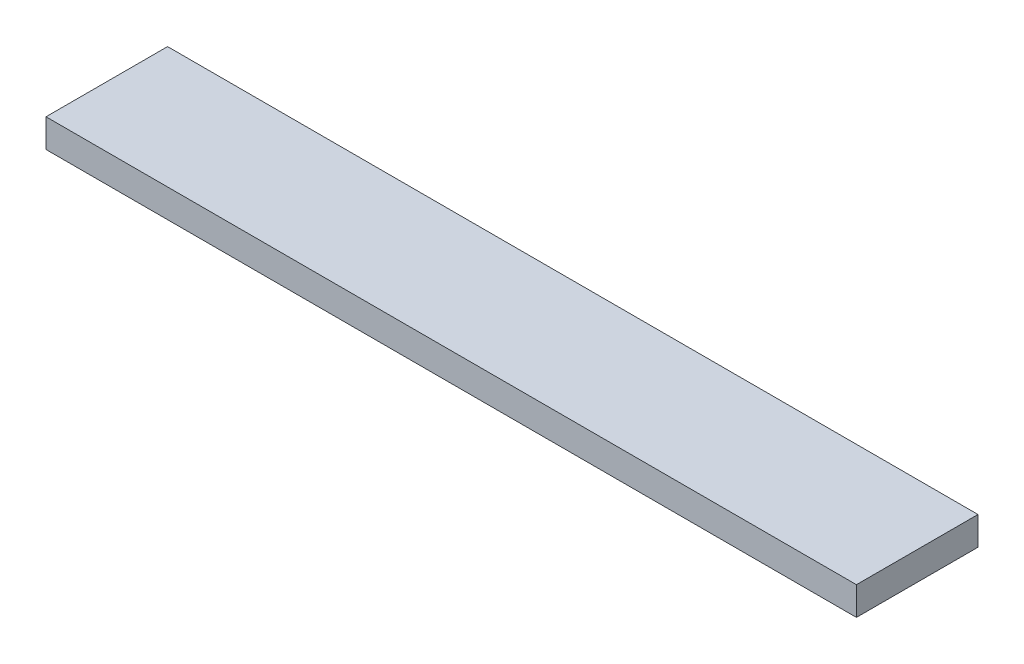
ISO-10303-21;
HEADER;
FILE_DESCRIPTION(('STEP AP214'),'2;1');
FILE_NAME('part.step','',(''),(''),'','','');
FILE_SCHEMA(('AUTOMOTIVE_DESIGN { 1 0 10303 214 1 1 1 1 }'));
ENDSEC;
DATA;
#1=APPLICATION_CONTEXT('core data for automotive mechanical design processes');
#2=APPLICATION_PROTOCOL_DEFINITION('international standard','automotive_design',2000,#1);
#3=PRODUCT_CONTEXT('',#1,'mechanical');
#4=PRODUCT('Part','Part','',(#3));
#5=PRODUCT_RELATED_PRODUCT_CATEGORY('part','',(#4));
#6=PRODUCT_DEFINITION_FORMATION('','',#4);
#7=PRODUCT_DEFINITION_CONTEXT('part definition',#1,'design');
#8=PRODUCT_DEFINITION('design','',#6,#7);
#9=PRODUCT_DEFINITION_SHAPE('','',#8);
#10=(LENGTH_UNIT() NAMED_UNIT(*) SI_UNIT(.MILLI.,.METRE.));
#11=(NAMED_UNIT(*) PLANE_ANGLE_UNIT() SI_UNIT($,.RADIAN.));
#12=(NAMED_UNIT(*) SI_UNIT($,.STERADIAN.) SOLID_ANGLE_UNIT());
#13=UNCERTAINTY_MEASURE_WITH_UNIT(LENGTH_MEASURE(1.E-05),#10,'distance_accuracy_value','');
#14=(GEOMETRIC_REPRESENTATION_CONTEXT(3) GLOBAL_UNCERTAINTY_ASSIGNED_CONTEXT((#13)) GLOBAL_UNIT_ASSIGNED_CONTEXT((#10,
#11,#12)) REPRESENTATION_CONTEXT('',''));
#15=CARTESIAN_POINT('',(0.,0.,0.));
#16=DIRECTION('',(0.,0.,1.));
#17=DIRECTION('',(1.,0.,0.));
#18=AXIS2_PLACEMENT_3D('',#15,#16,#17);
#19=CARTESIAN_POINT('',(-500.,17.4999999999999,150.));
#20=DIRECTION('',(1.,0.,0.));
#21=DIRECTION('',(0.,0.,-1.));
#22=AXIS2_PLACEMENT_3D('',#19,#20,#21);
#23=PLANE('',#22);
#24=DIRECTION('',(0.,-1.,0.));
#25=VECTOR('',#24,1.);
#26=CARTESIAN_POINT('',(-500.,17.4999999999999,0.));
#27=LINE('',#26,#25);
#28=CARTESIAN_POINT('',(-500.,17.4999999999999,0.));
#29=VERTEX_POINT('',#28);
#30=CARTESIAN_POINT('',(-500.,-17.5000000000001,0.));
#31=VERTEX_POINT('',#30);
#32=EDGE_CURVE('E107',#29,#31,#27,.T.);
#33=ORIENTED_EDGE('',*,*,#32,.T.);
#34=DIRECTION('',(0.,0.,-1.));
#35=VECTOR('',#34,1.);
#36=CARTESIAN_POINT('',(-500.,-17.5000000000001,150.));
#37=LINE('',#36,#35);
#38=CARTESIAN_POINT('',(-500.,-17.5000000000001,150.));
#39=VERTEX_POINT('',#38);
#40=EDGE_CURVE('E11',#39,#31,#37,.T.);
#41=ORIENTED_EDGE('',*,*,#40,.F.);
#42=DIRECTION('',(0.,-1.,0.));
#43=VECTOR('',#42,1.);
#44=CARTESIAN_POINT('',(-500.,17.4999999999999,150.));
#45=LINE('',#44,#43);
#46=CARTESIAN_POINT('',(-500.,17.4999999999999,150.));
#47=VERTEX_POINT('',#46);
#48=EDGE_CURVE('E91',#47,#39,#45,.T.);
#49=ORIENTED_EDGE('',*,*,#48,.F.);
#50=DIRECTION('',(0.,0.,-1.));
#51=VECTOR('',#50,1.);
#52=CARTESIAN_POINT('',(-500.,17.4999999999999,150.));
#53=LINE('',#52,#51);
#54=EDGE_CURVE('E103',#47,#29,#53,.T.);
#55=ORIENTED_EDGE('',*,*,#54,.T.);
#56=EDGE_LOOP('',(#33,#41,#49,#55));
#57=FACE_BOUND('',#56,.T.);
#58=ADVANCED_FACE('F39',(#57),#23,.F.);
#59=CARTESIAN_POINT('',(500.,-17.4999999999999,150.));
#60=DIRECTION('',(0.,1.,0.));
#61=DIRECTION('',(-1.,0.,0.));
#62=AXIS2_PLACEMENT_3D('',#59,#60,#61);
#63=PLANE('',#62);
#64=DIRECTION('',(1.,0.,0.));
#65=VECTOR('',#64,1.);
#66=CARTESIAN_POINT('',(500.,-17.4999999999999,0.));
#67=LINE('',#66,#65);
#68=CARTESIAN_POINT('',(500.,-17.4999999999999,0.));
#69=VERTEX_POINT('',#68);
#70=EDGE_CURVE('E96',#31,#69,#67,.T.);
#71=ORIENTED_EDGE('',*,*,#70,.T.);
#72=DIRECTION('',(0.,0.,-1.));
#73=VECTOR('',#72,1.);
#74=CARTESIAN_POINT('',(500.,-17.4999999999999,150.));
#75=LINE('',#74,#73);
#76=CARTESIAN_POINT('',(500.,-17.4999999999999,150.));
#77=VERTEX_POINT('',#76);
#78=EDGE_CURVE('E48',#77,#69,#75,.T.);
#79=ORIENTED_EDGE('',*,*,#78,.F.);
#80=DIRECTION('',(1.,0.,0.));
#81=VECTOR('',#80,1.);
#82=CARTESIAN_POINT('',(500.,-17.4999999999999,150.));
#83=LINE('',#82,#81);
#84=EDGE_CURVE('E86',#39,#77,#83,.T.);
#85=ORIENTED_EDGE('',*,*,#84,.F.);
#86=ORIENTED_EDGE('',*,*,#40,.T.);
#87=EDGE_LOOP('',(#71,#79,#85,#86));
#88=FACE_BOUND('',#87,.T.);
#89=ADVANCED_FACE('F95',(#88),#63,.F.);
#90=CARTESIAN_POINT('',(500.,17.5000000000001,150.));
#91=DIRECTION('',(-1.,0.,0.));
#92=DIRECTION('',(0.,0.,1.));
#93=AXIS2_PLACEMENT_3D('',#90,#91,#92);
#94=PLANE('',#93);
#95=DIRECTION('',(0.,1.,0.));
#96=VECTOR('',#95,1.);
#97=CARTESIAN_POINT('',(500.,17.5000000000001,0.));
#98=LINE('',#97,#96);
#99=CARTESIAN_POINT('',(500.,17.5000000000001,0.));
#100=VERTEX_POINT('',#99);
#101=EDGE_CURVE('E73',#69,#100,#98,.T.);
#102=ORIENTED_EDGE('',*,*,#101,.T.);
#103=DIRECTION('',(0.,0.,-1.));
#104=VECTOR('',#103,1.);
#105=CARTESIAN_POINT('',(500.,17.5000000000001,150.));
#106=LINE('',#105,#104);
#107=CARTESIAN_POINT('',(500.,17.5000000000001,150.));
#108=VERTEX_POINT('',#107);
#109=EDGE_CURVE('E98',#108,#100,#106,.T.);
#110=ORIENTED_EDGE('',*,*,#109,.F.);
#111=DIRECTION('',(0.,1.,0.));
#112=VECTOR('',#111,1.);
#113=CARTESIAN_POINT('',(500.,17.5000000000001,150.));
#114=LINE('',#113,#112);
#115=EDGE_CURVE('E89',#77,#108,#114,.T.);
#116=ORIENTED_EDGE('',*,*,#115,.F.);
#117=ORIENTED_EDGE('',*,*,#78,.T.);
#118=EDGE_LOOP('',(#102,#110,#116,#117));
#119=FACE_BOUND('',#118,.T.);
#120=ADVANCED_FACE('F99',(#119),#94,.F.);
#121=CARTESIAN_POINT('',(500.,17.5000000000001,150.));
#122=DIRECTION('',(0.,-1.,0.));
#123=DIRECTION('',(1.,0.,0.));
#124=AXIS2_PLACEMENT_3D('',#121,#122,#123);
#125=PLANE('',#124);
#126=DIRECTION('',(-1.,0.,0.));
#127=VECTOR('',#126,1.);
#128=CARTESIAN_POINT('',(500.,17.5000000000001,0.));
#129=LINE('',#128,#127);
#130=EDGE_CURVE('E79',#100,#29,#129,.T.);
#131=ORIENTED_EDGE('',*,*,#130,.T.);
#132=ORIENTED_EDGE('',*,*,#54,.F.);
#133=DIRECTION('',(-1.,0.,0.));
#134=VECTOR('',#133,1.);
#135=CARTESIAN_POINT('',(500.,17.5000000000001,150.));
#136=LINE('',#135,#134);
#137=EDGE_CURVE('E56',#108,#47,#136,.T.);
#138=ORIENTED_EDGE('',*,*,#137,.F.);
#139=ORIENTED_EDGE('',*,*,#109,.T.);
#140=EDGE_LOOP('',(#131,#132,#138,#139));
#141=FACE_BOUND('',#140,.T.);
#142=ADVANCED_FACE('F120',(#141),#125,.F.);
#143=CARTESIAN_POINT('',(0.,0.,150.));
#144=DIRECTION('',(0.,0.,-1.));
#145=DIRECTION('',(-1.,0.,0.));
#146=AXIS2_PLACEMENT_3D('',#143,#144,#145);
#147=PLANE('',#146);
#148=ORIENTED_EDGE('',*,*,#48,.T.);
#149=ORIENTED_EDGE('',*,*,#84,.T.);
#150=ORIENTED_EDGE('',*,*,#115,.T.);
#151=ORIENTED_EDGE('',*,*,#137,.T.);
#152=EDGE_LOOP('',(#148,#149,#150,#151));
#153=FACE_BOUND('',#152,.T.);
#154=ADVANCED_FACE('F87',(#153),#147,.F.);
#155=CARTESIAN_POINT('',(0.,0.,0.));
#156=DIRECTION('',(0.,0.,-1.));
#157=DIRECTION('',(-1.,0.,0.));
#158=AXIS2_PLACEMENT_3D('',#155,#156,#157);
#159=PLANE('',#158);
#160=ORIENTED_EDGE('',*,*,#32,.F.);
#161=ORIENTED_EDGE('',*,*,#130,.F.);
#162=ORIENTED_EDGE('',*,*,#101,.F.);
#163=ORIENTED_EDGE('',*,*,#70,.F.);
#164=EDGE_LOOP('',(#160,#161,#162,#163));
#165=FACE_BOUND('',#164,.T.);
#166=ADVANCED_FACE('F123',(#165),#159,.T.);
#167=CLOSED_SHELL('',(#58,#89,#120,#142,#154,#166));
#168=MANIFOLD_SOLID_BREP('B2',#167);
#169=ADVANCED_BREP_SHAPE_REPRESENTATION('',(#18,#168),#14);
#170=SHAPE_DEFINITION_REPRESENTATION(#9,#169);
ENDSEC;
END-ISO-10303-21;
